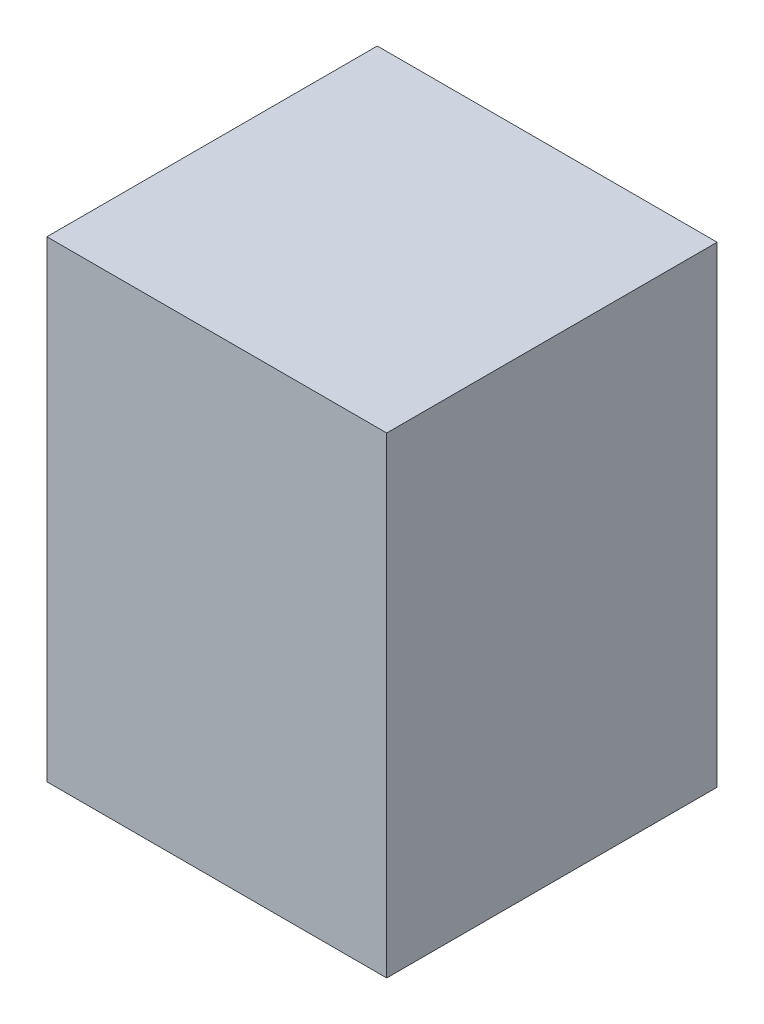
ISO-10303-21;
HEADER;
FILE_DESCRIPTION(('STEP AP214'),'2;1');
FILE_NAME('part.step','',(''),(''),'','','');
FILE_SCHEMA(('AUTOMOTIVE_DESIGN { 1 0 10303 214 1 1 1 1 }'));
ENDSEC;
DATA;
#1=APPLICATION_CONTEXT('core data for automotive mechanical design processes');
#2=APPLICATION_PROTOCOL_DEFINITION('international standard','automotive_design',2000,#1);
#3=PRODUCT_CONTEXT('',#1,'mechanical');
#4=PRODUCT('Part','Part','',(#3));
#5=PRODUCT_RELATED_PRODUCT_CATEGORY('part','',(#4));
#6=PRODUCT_DEFINITION_FORMATION('','',#4);
#7=PRODUCT_DEFINITION_CONTEXT('part definition',#1,'design');
#8=PRODUCT_DEFINITION('design','',#6,#7);
#9=PRODUCT_DEFINITION_SHAPE('','',#8);
#10=(LENGTH_UNIT() NAMED_UNIT(*) SI_UNIT(.MILLI.,.METRE.));
#11=(NAMED_UNIT(*) PLANE_ANGLE_UNIT() SI_UNIT($,.RADIAN.));
#12=(NAMED_UNIT(*) SI_UNIT($,.STERADIAN.) SOLID_ANGLE_UNIT());
#13=UNCERTAINTY_MEASURE_WITH_UNIT(LENGTH_MEASURE(1.E-05),#10,'distance_accuracy_value','');
#14=(GEOMETRIC_REPRESENTATION_CONTEXT(3) GLOBAL_UNCERTAINTY_ASSIGNED_CONTEXT((#13)) GLOBAL_UNIT_ASSIGNED_CONTEXT((#10,
#11,#12)) REPRESENTATION_CONTEXT('',''));
#15=CARTESIAN_POINT('',(0.,0.,0.));
#16=DIRECTION('',(0.,0.,1.));
#17=DIRECTION('',(1.,0.,0.));
#18=AXIS2_PLACEMENT_3D('',#15,#16,#17);
#19=CARTESIAN_POINT('',(0.,100.,0.));
#20=DIRECTION('',(1.,0.,0.));
#21=DIRECTION('',(0.,0.,-1.));
#22=AXIS2_PLACEMENT_3D('',#19,#20,#21);
#23=PLANE('',#22);
#24=DIRECTION('',(0.,0.,1.));
#25=VECTOR('',#24,1.);
#26=CARTESIAN_POINT('',(0.,0.,0.));
#27=LINE('',#26,#25);
#28=CARTESIAN_POINT('',(0.,0.,-70.));
#29=VERTEX_POINT('',#28);
#30=CARTESIAN_POINT('',(0.,0.,0.));
#31=VERTEX_POINT('',#30);
#32=EDGE_CURVE('E98',#29,#31,#27,.T.);
#33=ORIENTED_EDGE('',*,*,#32,.T.);
#34=DIRECTION('',(0.,-1.,0.));
#35=VECTOR('',#34,1.);
#36=CARTESIAN_POINT('',(0.,100.,0.));
#37=LINE('',#36,#35);
#38=CARTESIAN_POINT('',(0.,100.,0.));
#39=VERTEX_POINT('',#38);
#40=EDGE_CURVE('E11',#39,#31,#37,.T.);
#41=ORIENTED_EDGE('',*,*,#40,.F.);
#42=DIRECTION('',(0.,0.,1.));
#43=VECTOR('',#42,1.);
#44=CARTESIAN_POINT('',(0.,100.,0.));
#45=LINE('',#44,#43);
#46=CARTESIAN_POINT('',(0.,100.,-70.));
#47=VERTEX_POINT('',#46);
#48=EDGE_CURVE('E86',#47,#39,#45,.T.);
#49=ORIENTED_EDGE('',*,*,#48,.F.);
#50=DIRECTION('',(0.,-1.,0.));
#51=VECTOR('',#50,1.);
#52=CARTESIAN_POINT('',(0.,100.,-70.));
#53=LINE('',#52,#51);
#54=EDGE_CURVE('E94',#47,#29,#53,.T.);
#55=ORIENTED_EDGE('',*,*,#54,.T.);
#56=EDGE_LOOP('',(#33,#41,#49,#55));
#57=FACE_BOUND('',#56,.T.);
#58=ADVANCED_FACE('F35',(#57),#23,.F.);
#59=CARTESIAN_POINT('',(0.,100.,0.));
#60=DIRECTION('',(0.,0.,-1.));
#61=DIRECTION('',(-1.,0.,0.));
#62=AXIS2_PLACEMENT_3D('',#59,#60,#61);
#63=PLANE('',#62);
#64=DIRECTION('',(1.,0.,0.));
#65=VECTOR('',#64,1.);
#66=CARTESIAN_POINT('',(0.,0.,0.));
#67=LINE('',#66,#65);
#68=CARTESIAN_POINT('',(72.,0.,0.));
#69=VERTEX_POINT('',#68);
#70=EDGE_CURVE('E90',#31,#69,#67,.T.);
#71=ORIENTED_EDGE('',*,*,#70,.T.);
#72=DIRECTION('',(0.,-1.,0.));
#73=VECTOR('',#72,1.);
#74=CARTESIAN_POINT('',(72.,100.,0.));
#75=LINE('',#74,#73);
#76=CARTESIAN_POINT('',(72.,100.,0.));
#77=VERTEX_POINT('',#76);
#78=EDGE_CURVE('E43',#77,#69,#75,.T.);
#79=ORIENTED_EDGE('',*,*,#78,.F.);
#80=DIRECTION('',(1.,0.,0.));
#81=VECTOR('',#80,1.);
#82=CARTESIAN_POINT('',(0.,100.,0.));
#83=LINE('',#82,#81);
#84=EDGE_CURVE('E81',#39,#77,#83,.T.);
#85=ORIENTED_EDGE('',*,*,#84,.F.);
#86=ORIENTED_EDGE('',*,*,#40,.T.);
#87=EDGE_LOOP('',(#71,#79,#85,#86));
#88=FACE_BOUND('',#87,.T.);
#89=ADVANCED_FACE('F89',(#88),#63,.F.);
#90=CARTESIAN_POINT('',(72.,100.,0.));
#91=DIRECTION('',(-1.,0.,0.));
#92=DIRECTION('',(0.,0.,1.));
#93=AXIS2_PLACEMENT_3D('',#90,#91,#92);
#94=PLANE('',#93);
#95=DIRECTION('',(0.,0.,-1.));
#96=VECTOR('',#95,1.);
#97=CARTESIAN_POINT('',(72.,0.,0.));
#98=LINE('',#97,#96);
#99=CARTESIAN_POINT('',(72.,0.,-70.));
#100=VERTEX_POINT('',#99);
#101=EDGE_CURVE('E68',#69,#100,#98,.T.);
#102=ORIENTED_EDGE('',*,*,#101,.T.);
#103=DIRECTION('',(0.,-1.,0.));
#104=VECTOR('',#103,1.);
#105=CARTESIAN_POINT('',(72.,100.,-70.));
#106=LINE('',#105,#104);
#107=CARTESIAN_POINT('',(72.,100.,-70.));
#108=VERTEX_POINT('',#107);
#109=EDGE_CURVE('E91',#108,#100,#106,.T.);
#110=ORIENTED_EDGE('',*,*,#109,.F.);
#111=DIRECTION('',(0.,0.,-1.));
#112=VECTOR('',#111,1.);
#113=CARTESIAN_POINT('',(72.,100.,0.));
#114=LINE('',#113,#112);
#115=EDGE_CURVE('E84',#77,#108,#114,.T.);
#116=ORIENTED_EDGE('',*,*,#115,.F.);
#117=ORIENTED_EDGE('',*,*,#78,.T.);
#118=EDGE_LOOP('',(#102,#110,#116,#117));
#119=FACE_BOUND('',#118,.T.);
#120=ADVANCED_FACE('F92',(#119),#94,.F.);
#121=CARTESIAN_POINT('',(0.,100.,-70.));
#122=DIRECTION('',(0.,0.,1.));
#123=DIRECTION('',(1.,0.,0.));
#124=AXIS2_PLACEMENT_3D('',#121,#122,#123);
#125=PLANE('',#124);
#126=DIRECTION('',(-1.,0.,0.));
#127=VECTOR('',#126,1.);
#128=CARTESIAN_POINT('',(0.,0.,-70.));
#129=LINE('',#128,#127);
#130=EDGE_CURVE('E74',#100,#29,#129,.T.);
#131=ORIENTED_EDGE('',*,*,#130,.T.);
#132=ORIENTED_EDGE('',*,*,#54,.F.);
#133=DIRECTION('',(-1.,0.,0.));
#134=VECTOR('',#133,1.);
#135=CARTESIAN_POINT('',(0.,100.,-70.));
#136=LINE('',#135,#134);
#137=EDGE_CURVE('E51',#108,#47,#136,.T.);
#138=ORIENTED_EDGE('',*,*,#137,.F.);
#139=ORIENTED_EDGE('',*,*,#109,.T.);
#140=EDGE_LOOP('',(#131,#132,#138,#139));
#141=FACE_BOUND('',#140,.T.);
#142=ADVANCED_FACE('F105',(#141),#125,.F.);
#143=CARTESIAN_POINT('',(0.,100.,0.));
#144=DIRECTION('',(0.,-1.,0.));
#145=DIRECTION('',(0.,0.,-1.));
#146=AXIS2_PLACEMENT_3D('',#143,#144,#145);
#147=PLANE('',#146);
#148=ORIENTED_EDGE('',*,*,#48,.T.);
#149=ORIENTED_EDGE('',*,*,#84,.T.);
#150=ORIENTED_EDGE('',*,*,#115,.T.);
#151=ORIENTED_EDGE('',*,*,#137,.T.);
#152=EDGE_LOOP('',(#148,#149,#150,#151));
#153=FACE_BOUND('',#152,.T.);
#154=ADVANCED_FACE('F82',(#153),#147,.F.);
#155=CARTESIAN_POINT('',(0.,0.,0.));
#156=DIRECTION('',(0.,-1.,0.));
#157=DIRECTION('',(0.,0.,-1.));
#158=AXIS2_PLACEMENT_3D('',#155,#156,#157);
#159=PLANE('',#158);
#160=ORIENTED_EDGE('',*,*,#32,.F.);
#161=ORIENTED_EDGE('',*,*,#130,.F.);
#162=ORIENTED_EDGE('',*,*,#101,.F.);
#163=ORIENTED_EDGE('',*,*,#70,.F.);
#164=EDGE_LOOP('',(#160,#161,#162,#163));
#165=FACE_BOUND('',#164,.T.);
#166=ADVANCED_FACE('F108',(#165),#159,.T.);
#167=CLOSED_SHELL('',(#58,#89,#120,#142,#154,#166));
#168=MANIFOLD_SOLID_BREP('B2',#167);
#169=ADVANCED_BREP_SHAPE_REPRESENTATION('',(#18,#168),#14);
#170=SHAPE_DEFINITION_REPRESENTATION(#9,#169);
ENDSEC;
END-ISO-10303-21;
